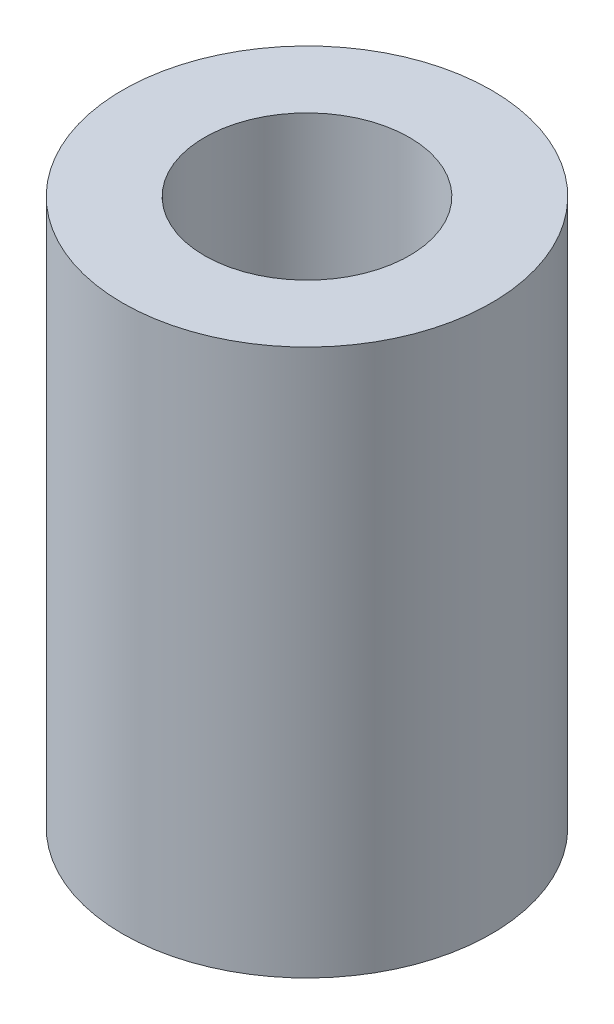
ISO-10303-21;
HEADER;
FILE_DESCRIPTION(('STEP AP214'),'2;1');
FILE_NAME('part.step','',(''),(''),'','','');
FILE_SCHEMA(('AUTOMOTIVE_DESIGN { 1 0 10303 214 1 1 1 1 }'));
ENDSEC;
DATA;
#1=APPLICATION_CONTEXT('core data for automotive mechanical design processes');
#2=APPLICATION_PROTOCOL_DEFINITION('international standard','automotive_design',2000,#1);
#3=PRODUCT_CONTEXT('',#1,'mechanical');
#4=PRODUCT('Part','Part','',(#3));
#5=PRODUCT_RELATED_PRODUCT_CATEGORY('part','',(#4));
#6=PRODUCT_DEFINITION_FORMATION('','',#4);
#7=PRODUCT_DEFINITION_CONTEXT('part definition',#1,'design');
#8=PRODUCT_DEFINITION('design','',#6,#7);
#9=PRODUCT_DEFINITION_SHAPE('','',#8);
#10=(LENGTH_UNIT() NAMED_UNIT(*) SI_UNIT(.MILLI.,.METRE.));
#11=(NAMED_UNIT(*) PLANE_ANGLE_UNIT() SI_UNIT($,.RADIAN.));
#12=(NAMED_UNIT(*) SI_UNIT($,.STERADIAN.) SOLID_ANGLE_UNIT());
#13=UNCERTAINTY_MEASURE_WITH_UNIT(LENGTH_MEASURE(1.E-05),#10,'distance_accuracy_value','');
#14=(GEOMETRIC_REPRESENTATION_CONTEXT(3) GLOBAL_UNCERTAINTY_ASSIGNED_CONTEXT((#13)) GLOBAL_UNIT_ASSIGNED_CONTEXT((#10,
#11,#12)) REPRESENTATION_CONTEXT('',''));
#15=CARTESIAN_POINT('',(0.,0.,0.));
#16=DIRECTION('',(0.,0.,1.));
#17=DIRECTION('',(1.,0.,0.));
#18=AXIS2_PLACEMENT_3D('',#15,#16,#17);
#19=CARTESIAN_POINT('',(0.,10.,0.));
#20=DIRECTION('',(0.,1.,0.));
#21=DIRECTION('',(0.,0.,1.));
#22=AXIS2_PLACEMENT_3D('',#19,#20,#21);
#23=PLANE('',#22);
#24=CARTESIAN_POINT('',(0.,10.,0.));
#25=DIRECTION('',(0.,1.,0.));
#26=DIRECTION('',(0.,0.,1.));
#27=AXIS2_PLACEMENT_3D('',#24,#25,#26);
#28=CIRCLE('',#27,3.375);
#29=CARTESIAN_POINT('',(0.,10.,3.375));
#30=VERTEX_POINT('',#29);
#31=EDGE_CURVE('E10',#30,#30,#28,.T.);
#32=ORIENTED_EDGE('',*,*,#31,.T.);
#33=EDGE_LOOP('',(#32));
#34=FACE_BOUND('',#33,.T.);
#35=CARTESIAN_POINT('',(0.,10.,0.));
#36=DIRECTION('',(0.,1.,0.));
#37=DIRECTION('',(0.,0.,1.));
#38=AXIS2_PLACEMENT_3D('',#35,#36,#37);
#39=CIRCLE('',#38,1.875);
#40=CARTESIAN_POINT('',(0.,10.,1.875));
#41=VERTEX_POINT('',#40);
#42=EDGE_CURVE('E46',#41,#41,#39,.T.);
#43=ORIENTED_EDGE('',*,*,#42,.F.);
#44=EDGE_LOOP('',(#43));
#45=FACE_BOUND('',#44,.T.);
#46=ADVANCED_FACE('F35',(#34,#45),#23,.T.);
#47=CARTESIAN_POINT('',(0.,0.,0.));
#48=DIRECTION('',(0.,1.,0.));
#49=DIRECTION('',(0.,0.,1.));
#50=AXIS2_PLACEMENT_3D('',#47,#48,#49);
#51=PLANE('',#50);
#52=CARTESIAN_POINT('',(0.,0.,0.));
#53=DIRECTION('',(0.,1.,0.));
#54=DIRECTION('',(0.,0.,1.));
#55=AXIS2_PLACEMENT_3D('',#52,#53,#54);
#56=CIRCLE('',#55,3.375);
#57=CARTESIAN_POINT('',(0.,0.,3.375));
#58=VERTEX_POINT('',#57);
#59=EDGE_CURVE('E39',#58,#58,#56,.T.);
#60=ORIENTED_EDGE('',*,*,#59,.F.);
#61=EDGE_LOOP('',(#60));
#62=FACE_BOUND('',#61,.T.);
#63=CARTESIAN_POINT('',(0.,0.,0.));
#64=DIRECTION('',(0.,1.,0.));
#65=DIRECTION('',(0.,0.,1.));
#66=AXIS2_PLACEMENT_3D('',#63,#64,#65);
#67=CIRCLE('',#66,1.875);
#68=CARTESIAN_POINT('',(0.,0.,1.875));
#69=VERTEX_POINT('',#68);
#70=EDGE_CURVE('E48',#69,#69,#67,.T.);
#71=ORIENTED_EDGE('',*,*,#70,.T.);
#72=EDGE_LOOP('',(#71));
#73=FACE_BOUND('',#72,.T.);
#74=ADVANCED_FACE('F58',(#62,#73),#51,.F.);
#75=CARTESIAN_POINT('',(0.,10.,0.));
#76=DIRECTION('',(0.,-1.,0.));
#77=DIRECTION('',(0.,0.,-1.));
#78=AXIS2_PLACEMENT_3D('',#75,#76,#77);
#79=CYLINDRICAL_SURFACE('',#78,3.375);
#80=ORIENTED_EDGE('',*,*,#31,.F.);
#81=EDGE_LOOP('',(#80));
#82=FACE_BOUND('',#81,.T.);
#83=ORIENTED_EDGE('',*,*,#59,.T.);
#84=EDGE_LOOP('',(#83));
#85=FACE_BOUND('',#84,.T.);
#86=ADVANCED_FACE('F37',(#82,#85),#79,.T.);
#87=CARTESIAN_POINT('',(0.,10.,0.));
#88=DIRECTION('',(0.,-1.,0.));
#89=DIRECTION('',(0.,0.,-1.));
#90=AXIS2_PLACEMENT_3D('',#87,#88,#89);
#91=CYLINDRICAL_SURFACE('',#90,1.875);
#92=ORIENTED_EDGE('',*,*,#42,.T.);
#93=EDGE_LOOP('',(#92));
#94=FACE_BOUND('',#93,.T.);
#95=ORIENTED_EDGE('',*,*,#70,.F.);
#96=EDGE_LOOP('',(#95));
#97=FACE_BOUND('',#96,.T.);
#98=ADVANCED_FACE('F54',(#94,#97),#91,.F.);
#99=CLOSED_SHELL('',(#46,#74,#86,#98));
#100=MANIFOLD_SOLID_BREP('B2',#99);
#101=ADVANCED_BREP_SHAPE_REPRESENTATION('',(#18,#100),#14);
#102=SHAPE_DEFINITION_REPRESENTATION(#9,#101);
ENDSEC;
END-ISO-10303-21;
